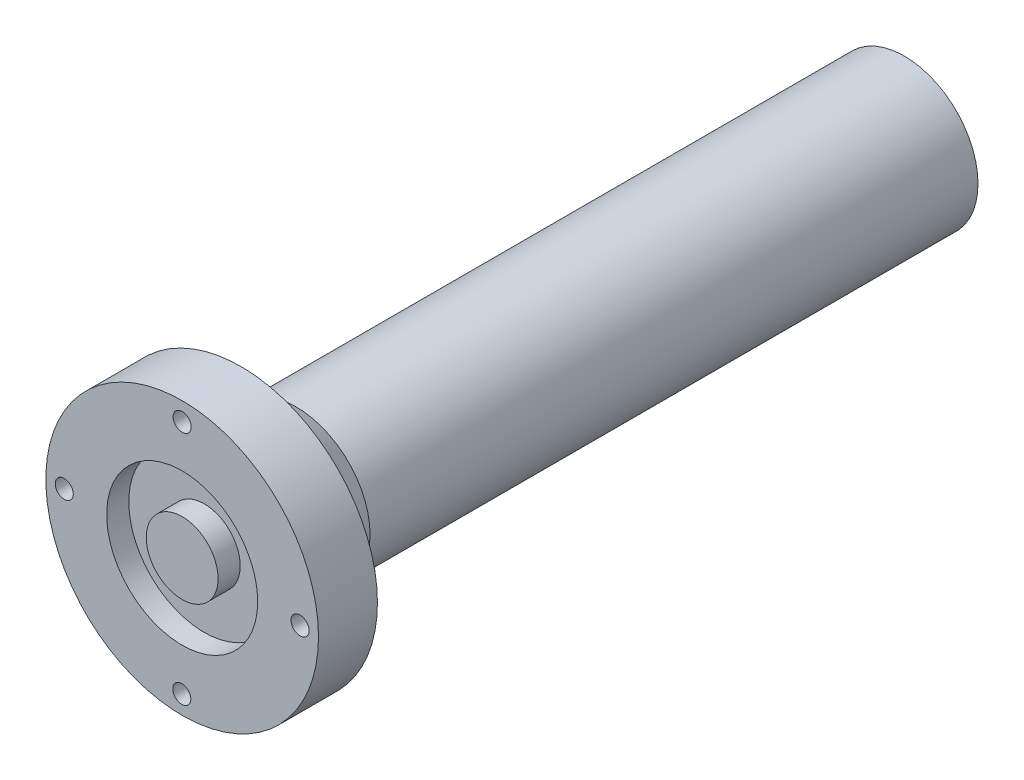
ISO-10303-21;
HEADER;
FILE_DESCRIPTION(('STEP AP214'),'2;1');
FILE_NAME('part.step','',(''),(''),'','','');
FILE_SCHEMA(('AUTOMOTIVE_DESIGN { 1 0 10303 214 1 1 1 1 }'));
ENDSEC;
DATA;
#1=APPLICATION_CONTEXT('core data for automotive mechanical design processes');
#2=APPLICATION_PROTOCOL_DEFINITION('international standard','automotive_design',2000,#1);
#3=PRODUCT_CONTEXT('',#1,'mechanical');
#4=PRODUCT('Part','Part','',(#3));
#5=PRODUCT_RELATED_PRODUCT_CATEGORY('part','',(#4));
#6=PRODUCT_DEFINITION_FORMATION('','',#4);
#7=PRODUCT_DEFINITION_CONTEXT('part definition',#1,'design');
#8=PRODUCT_DEFINITION('design','',#6,#7);
#9=PRODUCT_DEFINITION_SHAPE('','',#8);
#10=(LENGTH_UNIT() NAMED_UNIT(*) SI_UNIT(.MILLI.,.METRE.));
#11=(NAMED_UNIT(*) PLANE_ANGLE_UNIT() SI_UNIT($,.RADIAN.));
#12=(NAMED_UNIT(*) SI_UNIT($,.STERADIAN.) SOLID_ANGLE_UNIT());
#13=UNCERTAINTY_MEASURE_WITH_UNIT(LENGTH_MEASURE(1.E-05),#10,'distance_accuracy_value','');
#14=(GEOMETRIC_REPRESENTATION_CONTEXT(3) GLOBAL_UNCERTAINTY_ASSIGNED_CONTEXT((#13)) GLOBAL_UNIT_ASSIGNED_CONTEXT((#10,
#11,#12)) REPRESENTATION_CONTEXT('',''));
#15=CARTESIAN_POINT('',(0.,0.,0.));
#16=DIRECTION('',(0.,0.,1.));
#17=DIRECTION('',(1.,0.,0.));
#18=AXIS2_PLACEMENT_3D('',#15,#16,#17);
#19=CARTESIAN_POINT('',(-0.10813940247166,-32.,-0.001000000000001));
#20=DIRECTION('',(0.,0.,1.));
#21=DIRECTION('',(1.,0.,0.));
#22=AXIS2_PLACEMENT_3D('',#19,#20,#21);
#23=CYLINDRICAL_SURFACE('',#22,2.45);
#24=CARTESIAN_POINT('',(-0.10813940247166,-32.,196.));
#25=DIRECTION('',(0.,0.,1.));
#26=DIRECTION('',(1.,0.,0.));
#27=AXIS2_PLACEMENT_3D('',#24,#25,#26);
#28=CIRCLE('',#27,2.45);
#29=CARTESIAN_POINT('',(2.34186059752834,-32.,196.));
#30=VERTEX_POINT('',#29);
#31=EDGE_CURVE('E108',#30,#30,#28,.T.);
#32=ORIENTED_EDGE('',*,*,#31,.T.);
#33=EDGE_LOOP('',(#32));
#34=FACE_BOUND('',#33,.T.);
#35=CARTESIAN_POINT('',(-0.10813940247166,-32.,185.));
#36=DIRECTION('',(0.,0.,-1.));
#37=DIRECTION('',(-1.,0.,0.));
#38=AXIS2_PLACEMENT_3D('',#35,#36,#37);
#39=CIRCLE('',#38,2.45);
#40=CARTESIAN_POINT('',(-2.55813940247166,-32.,185.));
#41=VERTEX_POINT('',#40);
#42=EDGE_CURVE('E112',#41,#41,#39,.F.);
#43=ORIENTED_EDGE('',*,*,#42,.F.);
#44=EDGE_LOOP('',(#43));
#45=FACE_BOUND('',#44,.T.);
#46=ADVANCED_FACE('F43',(#34,#45),#23,.F.);
#47=CARTESIAN_POINT('',(-32.,0.258434211494532,-0.001000000000001));
#48=DIRECTION('',(0.,0.,1.));
#49=DIRECTION('',(1.,0.,0.));
#50=AXIS2_PLACEMENT_3D('',#47,#48,#49);
#51=CYLINDRICAL_SURFACE('',#50,2.45);
#52=CARTESIAN_POINT('',(-32.,0.258434211494532,196.));
#53=DIRECTION('',(0.,0.,1.));
#54=DIRECTION('',(1.,0.,0.));
#55=AXIS2_PLACEMENT_3D('',#52,#53,#54);
#56=CIRCLE('',#55,2.45);
#57=CARTESIAN_POINT('',(-29.55,0.258434211494532,196.));
#58=VERTEX_POINT('',#57);
#59=EDGE_CURVE('E104',#58,#58,#56,.T.);
#60=ORIENTED_EDGE('',*,*,#59,.T.);
#61=EDGE_LOOP('',(#60));
#62=FACE_BOUND('',#61,.T.);
#63=CARTESIAN_POINT('',(-32.,0.258434211494532,185.));
#64=DIRECTION('',(0.,0.,-1.));
#65=DIRECTION('',(-1.,0.,0.));
#66=AXIS2_PLACEMENT_3D('',#63,#64,#65);
#67=CIRCLE('',#66,2.45);
#68=CARTESIAN_POINT('',(-34.45,0.258434211494532,185.));
#69=VERTEX_POINT('',#68);
#70=EDGE_CURVE('E146',#69,#69,#67,.F.);
#71=ORIENTED_EDGE('',*,*,#70,.F.);
#72=EDGE_LOOP('',(#71));
#73=FACE_BOUND('',#72,.T.);
#74=ADVANCED_FACE('F156',(#62,#73),#51,.F.);
#75=CARTESIAN_POINT('',(32.,0.150294809022872,-0.001000000000001));
#76=DIRECTION('',(0.,0.,1.));
#77=DIRECTION('',(1.,0.,0.));
#78=AXIS2_PLACEMENT_3D('',#75,#76,#77);
#79=CYLINDRICAL_SURFACE('',#78,2.45);
#80=CARTESIAN_POINT('',(32.,0.150294809022872,196.));
#81=DIRECTION('',(0.,0.,1.));
#82=DIRECTION('',(1.,0.,0.));
#83=AXIS2_PLACEMENT_3D('',#80,#81,#82);
#84=CIRCLE('',#83,2.45);
#85=CARTESIAN_POINT('',(34.45,0.150294809022872,196.));
#86=VERTEX_POINT('',#85);
#87=EDGE_CURVE('E100',#86,#86,#84,.T.);
#88=ORIENTED_EDGE('',*,*,#87,.T.);
#89=EDGE_LOOP('',(#88));
#90=FACE_BOUND('',#89,.T.);
#91=CARTESIAN_POINT('',(32.,0.150294809022872,185.));
#92=DIRECTION('',(0.,0.,-1.));
#93=DIRECTION('',(-1.,0.,0.));
#94=AXIS2_PLACEMENT_3D('',#91,#92,#93);
#95=CIRCLE('',#94,2.45);
#96=CARTESIAN_POINT('',(29.55,0.150294809022872,185.));
#97=VERTEX_POINT('',#96);
#98=EDGE_CURVE('E142',#97,#97,#95,.F.);
#99=ORIENTED_EDGE('',*,*,#98,.F.);
#100=EDGE_LOOP('',(#99));
#101=FACE_BOUND('',#100,.T.);
#102=ADVANCED_FACE('F162',(#90,#101),#79,.F.);
#103=CARTESIAN_POINT('',(0.,32.,-0.001000000000001));
#104=DIRECTION('',(0.,0.,1.));
#105=DIRECTION('',(1.,0.,0.));
#106=AXIS2_PLACEMENT_3D('',#103,#104,#105);
#107=CYLINDRICAL_SURFACE('',#106,2.45);
#108=CARTESIAN_POINT('',(0.,32.,196.));
#109=DIRECTION('',(0.,0.,1.));
#110=DIRECTION('',(1.,0.,0.));
#111=AXIS2_PLACEMENT_3D('',#108,#109,#110);
#112=CIRCLE('',#111,2.45);
#113=CARTESIAN_POINT('',(2.45,32.,196.));
#114=VERTEX_POINT('',#113);
#115=EDGE_CURVE('E95',#114,#114,#112,.T.);
#116=ORIENTED_EDGE('',*,*,#115,.T.);
#117=EDGE_LOOP('',(#116));
#118=FACE_BOUND('',#117,.T.);
#119=CARTESIAN_POINT('',(0.,32.,185.));
#120=DIRECTION('',(0.,0.,-1.));
#121=DIRECTION('',(-1.,0.,0.));
#122=AXIS2_PLACEMENT_3D('',#119,#120,#121);
#123=CIRCLE('',#122,2.45);
#124=CARTESIAN_POINT('',(-2.45,32.,185.));
#125=VERTEX_POINT('',#124);
#126=EDGE_CURVE('E69',#125,#125,#123,.F.);
#127=ORIENTED_EDGE('',*,*,#126,.F.);
#128=EDGE_LOOP('',(#127));
#129=FACE_BOUND('',#128,.T.);
#130=ADVANCED_FACE('F192',(#118,#129),#107,.F.);
#131=CARTESIAN_POINT('',(0.,0.,196.));
#132=DIRECTION('',(0.,0.,-1.));
#133=DIRECTION('',(-1.,0.,0.));
#134=AXIS2_PLACEMENT_3D('',#131,#132,#133);
#135=CYLINDRICAL_SURFACE('',#134,37.);
#136=CARTESIAN_POINT('',(0.,0.,196.));
#137=DIRECTION('',(0.,0.,1.));
#138=DIRECTION('',(1.,0.,0.));
#139=AXIS2_PLACEMENT_3D('',#136,#137,#138);
#140=CIRCLE('',#139,37.);
#141=CARTESIAN_POINT('',(37.,0.,196.));
#142=VERTEX_POINT('',#141);
#143=EDGE_CURVE('E129',#142,#142,#140,.T.);
#144=ORIENTED_EDGE('',*,*,#143,.F.);
#145=EDGE_LOOP('',(#144));
#146=FACE_BOUND('',#145,.T.);
#147=CARTESIAN_POINT('',(0.,0.,180.));
#148=DIRECTION('',(0.,0.,1.));
#149=DIRECTION('',(1.,0.,0.));
#150=AXIS2_PLACEMENT_3D('',#147,#148,#149);
#151=CIRCLE('',#150,37.);
#152=CARTESIAN_POINT('',(37.,0.,180.));
#153=VERTEX_POINT('',#152);
#154=EDGE_CURVE('E125',#153,#153,#151,.T.);
#155=ORIENTED_EDGE('',*,*,#154,.T.);
#156=EDGE_LOOP('',(#155));
#157=FACE_BOUND('',#156,.T.);
#158=ADVANCED_FACE('F187',(#146,#157),#135,.T.);
#159=CARTESIAN_POINT('',(0.,0.,196.));
#160=DIRECTION('',(0.,0.,1.));
#161=DIRECTION('',(1.,0.,0.));
#162=AXIS2_PLACEMENT_3D('',#159,#160,#161);
#163=PLANE('',#162);
#164=ORIENTED_EDGE('',*,*,#115,.F.);
#165=EDGE_LOOP('',(#164));
#166=FACE_BOUND('',#165,.T.);
#167=ORIENTED_EDGE('',*,*,#87,.F.);
#168=EDGE_LOOP('',(#167));
#169=FACE_BOUND('',#168,.T.);
#170=ORIENTED_EDGE('',*,*,#59,.F.);
#171=EDGE_LOOP('',(#170));
#172=FACE_BOUND('',#171,.T.);
#173=ORIENTED_EDGE('',*,*,#31,.F.);
#174=EDGE_LOOP('',(#173));
#175=FACE_BOUND('',#174,.T.);
#176=CARTESIAN_POINT('',(0.,0.,196.));
#177=DIRECTION('',(0.,0.,1.));
#178=DIRECTION('',(1.,0.,0.));
#179=AXIS2_PLACEMENT_3D('',#176,#177,#178);
#180=CIRCLE('',#179,20.5);
#181=CARTESIAN_POINT('',(20.5,0.,196.));
#182=VERTEX_POINT('',#181);
#183=EDGE_CURVE('E117',#182,#182,#180,.T.);
#184=ORIENTED_EDGE('',*,*,#183,.F.);
#185=EDGE_LOOP('',(#184));
#186=FACE_BOUND('',#185,.T.);
#187=ORIENTED_EDGE('',*,*,#143,.T.);
#188=EDGE_LOOP('',(#187));
#189=FACE_BOUND('',#188,.T.);
#190=ADVANCED_FACE('F184',(#166,#169,#172,#175,#186,#189),#163,.T.);
#191=CARTESIAN_POINT('',(0.,0.,180.));
#192=DIRECTION('',(0.,0.,1.));
#193=DIRECTION('',(1.,0.,0.));
#194=AXIS2_PLACEMENT_3D('',#191,#192,#193);
#195=PLANE('',#194);
#196=CARTESIAN_POINT('',(0.,32.,180.));
#197=DIRECTION('',(0.,0.,-1.));
#198=DIRECTION('',(-1.,0.,0.));
#199=AXIS2_PLACEMENT_3D('',#196,#197,#198);
#200=CIRCLE('',#199,4.4);
#201=CARTESIAN_POINT('',(0.,27.6,180.));
#202=VERTEX_POINT('',#201);
#203=EDGE_CURVE('E56',#202,#202,#200,.T.);
#204=ORIENTED_EDGE('',*,*,#203,.F.);
#205=CARTESIAN_POINT('',(0.,0.,180.));
#206=DIRECTION('',(0.,0.,1.));
#207=DIRECTION('',(1.,0.,0.));
#208=AXIS2_PLACEMENT_3D('',#205,#206,#207);
#209=CIRCLE('',#208,27.6);
#210=EDGE_CURVE('E60',#202,#202,#209,.T.);
#211=ORIENTED_EDGE('',*,*,#210,.T.);
#212=EDGE_LOOP('',(#204,#211));
#213=FACE_BOUND('',#212,.T.);
#214=CARTESIAN_POINT('',(-32.,0.258434211494532,180.));
#215=DIRECTION('',(0.,0.,-1.));
#216=DIRECTION('',(-1.,0.,0.));
#217=AXIS2_PLACEMENT_3D('',#214,#215,#216);
#218=CIRCLE('',#217,4.4);
#219=CARTESIAN_POINT('',(-36.4,0.258434211494532,180.));
#220=VERTEX_POINT('',#219);
#221=EDGE_CURVE('E64',#220,#220,#218,.T.);
#222=ORIENTED_EDGE('',*,*,#221,.F.);
#223=EDGE_LOOP('',(#222));
#224=FACE_BOUND('',#223,.T.);
#225=CARTESIAN_POINT('',(-0.10813940247166,-32.,180.));
#226=DIRECTION('',(0.,0.,-1.));
#227=DIRECTION('',(-1.,0.,0.));
#228=AXIS2_PLACEMENT_3D('',#225,#226,#227);
#229=CIRCLE('',#228,4.4);
#230=CARTESIAN_POINT('',(-4.50813940247166,-32.,180.));
#231=VERTEX_POINT('',#230);
#232=EDGE_CURVE('E79',#231,#231,#229,.T.);
#233=ORIENTED_EDGE('',*,*,#232,.F.);
#234=EDGE_LOOP('',(#233));
#235=FACE_BOUND('',#234,.T.);
#236=CARTESIAN_POINT('',(32.,0.150294809022872,180.));
#237=DIRECTION('',(0.,0.,-1.));
#238=DIRECTION('',(-1.,0.,0.));
#239=AXIS2_PLACEMENT_3D('',#236,#237,#238);
#240=CIRCLE('',#239,4.4);
#241=CARTESIAN_POINT('',(27.6,0.150294809022872,180.));
#242=VERTEX_POINT('',#241);
#243=EDGE_CURVE('E87',#242,#242,#240,.T.);
#244=ORIENTED_EDGE('',*,*,#243,.F.);
#245=EDGE_LOOP('',(#244));
#246=FACE_BOUND('',#245,.T.);
#247=ORIENTED_EDGE('',*,*,#154,.F.);
#248=EDGE_LOOP('',(#247));
#249=FACE_BOUND('',#248,.T.);
#250=ADVANCED_FACE('F57',(#213,#224,#235,#246,#249),#195,.F.);
#251=CARTESIAN_POINT('',(0.,0.,190.));
#252=DIRECTION('',(0.,0.,1.));
#253=DIRECTION('',(1.,0.,0.));
#254=AXIS2_PLACEMENT_3D('',#251,#252,#253);
#255=CYLINDRICAL_SURFACE('',#254,20.5);
#256=CARTESIAN_POINT('',(0.,0.,190.));
#257=DIRECTION('',(0.,0.,1.));
#258=DIRECTION('',(1.,0.,0.));
#259=AXIS2_PLACEMENT_3D('',#256,#257,#258);
#260=CIRCLE('',#259,20.5);
#261=CARTESIAN_POINT('',(20.5,0.,190.));
#262=VERTEX_POINT('',#261);
#263=EDGE_CURVE('E121',#262,#262,#260,.T.);
#264=ORIENTED_EDGE('',*,*,#263,.F.);
#265=EDGE_LOOP('',(#264));
#266=FACE_BOUND('',#265,.T.);
#267=ORIENTED_EDGE('',*,*,#183,.T.);
#268=EDGE_LOOP('',(#267));
#269=FACE_BOUND('',#268,.T.);
#270=ADVANCED_FACE('F179',(#266,#269),#255,.F.);
#271=CARTESIAN_POINT('',(0.,0.,190.));
#272=DIRECTION('',(0.,0.,1.));
#273=DIRECTION('',(1.,0.,0.));
#274=AXIS2_PLACEMENT_3D('',#271,#272,#273);
#275=PLANE('',#274);
#276=CARTESIAN_POINT('',(0.,0.,190.));
#277=DIRECTION('',(0.,0.,1.));
#278=DIRECTION('',(1.,0.,0.));
#279=AXIS2_PLACEMENT_3D('',#276,#277,#278);
#280=CIRCLE('',#279,9.75);
#281=CARTESIAN_POINT('',(9.75,0.,190.));
#282=VERTEX_POINT('',#281);
#283=EDGE_CURVE('E99',#282,#282,#280,.T.);
#284=ORIENTED_EDGE('',*,*,#283,.F.);
#285=EDGE_LOOP('',(#284));
#286=FACE_BOUND('',#285,.T.);
#287=ORIENTED_EDGE('',*,*,#263,.T.);
#288=EDGE_LOOP('',(#287));
#289=FACE_BOUND('',#288,.T.);
#290=ADVANCED_FACE('F175',(#286,#289),#275,.T.);
#291=CARTESIAN_POINT('',(0.,0.,196.));
#292=DIRECTION('',(0.,0.,-1.));
#293=DIRECTION('',(-1.,0.,0.));
#294=AXIS2_PLACEMENT_3D('',#291,#292,#293);
#295=CYLINDRICAL_SURFACE('',#294,9.75);
#296=CARTESIAN_POINT('',(0.,0.,196.));
#297=DIRECTION('',(0.,0.,1.));
#298=DIRECTION('',(1.,0.,0.));
#299=AXIS2_PLACEMENT_3D('',#296,#297,#298);
#300=CIRCLE('',#299,9.75);
#301=CARTESIAN_POINT('',(9.75,0.,196.));
#302=VERTEX_POINT('',#301);
#303=EDGE_CURVE('E113',#302,#302,#300,.T.);
#304=ORIENTED_EDGE('',*,*,#303,.F.);
#305=EDGE_LOOP('',(#304));
#306=FACE_BOUND('',#305,.T.);
#307=ORIENTED_EDGE('',*,*,#283,.T.);
#308=EDGE_LOOP('',(#307));
#309=FACE_BOUND('',#308,.T.);
#310=ADVANCED_FACE('F171',(#306,#309),#295,.T.);
#311=CARTESIAN_POINT('',(0.,0.,196.));
#312=DIRECTION('',(0.,0.,1.));
#313=DIRECTION('',(1.,0.,0.));
#314=AXIS2_PLACEMENT_3D('',#311,#312,#313);
#315=PLANE('',#314);
#316=ORIENTED_EDGE('',*,*,#303,.T.);
#317=EDGE_LOOP('',(#316));
#318=FACE_BOUND('',#317,.T.);
#319=ADVANCED_FACE('F167',(#318),#315,.T.);
#320=CARTESIAN_POINT('',(0.,32.,185.));
#321=DIRECTION('',(0.,0.,-1.));
#322=DIRECTION('',(-1.,0.,0.));
#323=AXIS2_PLACEMENT_3D('',#320,#321,#322);
#324=PLANE('',#323);
#325=CARTESIAN_POINT('',(0.,32.,185.));
#326=DIRECTION('',(0.,0.,-1.));
#327=DIRECTION('',(-1.,0.,0.));
#328=AXIS2_PLACEMENT_3D('',#325,#326,#327);
#329=CIRCLE('',#328,4.4);
#330=CARTESIAN_POINT('',(-4.4,32.,185.));
#331=VERTEX_POINT('',#330);
#332=EDGE_CURVE('E63',#331,#331,#329,.T.);
#333=ORIENTED_EDGE('',*,*,#332,.T.);
#334=EDGE_LOOP('',(#333));
#335=FACE_BOUND('',#334,.T.);
#336=ORIENTED_EDGE('',*,*,#126,.T.);
#337=EDGE_LOOP('',(#336));
#338=FACE_BOUND('',#337,.T.);
#339=ADVANCED_FACE('F170',(#335,#338),#324,.T.);
#340=CARTESIAN_POINT('',(0.,32.,185.));
#341=DIRECTION('',(0.,0.,-1.));
#342=DIRECTION('',(-1.,0.,0.));
#343=AXIS2_PLACEMENT_3D('',#340,#341,#342);
#344=CYLINDRICAL_SURFACE('',#343,4.4);
#345=ORIENTED_EDGE('',*,*,#332,.F.);
#346=EDGE_LOOP('',(#345));
#347=FACE_BOUND('',#346,.T.);
#348=ORIENTED_EDGE('',*,*,#203,.T.);
#349=EDGE_LOOP('',(#348));
#350=FACE_BOUND('',#349,.T.);
#351=ADVANCED_FACE('F220',(#347,#350),#344,.F.);
#352=CARTESIAN_POINT('',(32.,0.150294809022872,185.));
#353=DIRECTION('',(0.,0.,-1.));
#354=DIRECTION('',(-1.,0.,0.));
#355=AXIS2_PLACEMENT_3D('',#352,#353,#354);
#356=PLANE('',#355);
#357=CARTESIAN_POINT('',(32.,0.150294809022872,185.));
#358=DIRECTION('',(0.,0.,-1.));
#359=DIRECTION('',(-1.,0.,0.));
#360=AXIS2_PLACEMENT_3D('',#357,#358,#359);
#361=CIRCLE('',#360,4.4);
#362=CARTESIAN_POINT('',(27.6,0.150294809022872,185.));
#363=VERTEX_POINT('',#362);
#364=EDGE_CURVE('E91',#363,#363,#361,.T.);
#365=ORIENTED_EDGE('',*,*,#364,.T.);
#366=EDGE_LOOP('',(#365));
#367=FACE_BOUND('',#366,.T.);
#368=ORIENTED_EDGE('',*,*,#98,.T.);
#369=EDGE_LOOP('',(#368));
#370=FACE_BOUND('',#369,.T.);
#371=ADVANCED_FACE('F224',(#367,#370),#356,.T.);
#372=CARTESIAN_POINT('',(32.,0.150294809022872,185.));
#373=DIRECTION('',(0.,0.,-1.));
#374=DIRECTION('',(-1.,0.,0.));
#375=AXIS2_PLACEMENT_3D('',#372,#373,#374);
#376=CYLINDRICAL_SURFACE('',#375,4.4);
#377=ORIENTED_EDGE('',*,*,#364,.F.);
#378=EDGE_LOOP('',(#377));
#379=FACE_BOUND('',#378,.T.);
#380=ORIENTED_EDGE('',*,*,#243,.T.);
#381=EDGE_LOOP('',(#380));
#382=FACE_BOUND('',#381,.T.);
#383=ADVANCED_FACE('F232',(#379,#382),#376,.F.);
#384=CARTESIAN_POINT('',(-32.,0.258434211494532,185.));
#385=DIRECTION('',(0.,0.,-1.));
#386=DIRECTION('',(-1.,0.,0.));
#387=AXIS2_PLACEMENT_3D('',#384,#385,#386);
#388=PLANE('',#387);
#389=CARTESIAN_POINT('',(-32.,0.258434211494532,185.));
#390=DIRECTION('',(0.,0.,-1.));
#391=DIRECTION('',(-1.,0.,0.));
#392=AXIS2_PLACEMENT_3D('',#389,#390,#391);
#393=CIRCLE('',#392,4.4);
#394=CARTESIAN_POINT('',(-36.4,0.258434211494532,185.));
#395=VERTEX_POINT('',#394);
#396=EDGE_CURVE('E72',#395,#395,#393,.T.);
#397=ORIENTED_EDGE('',*,*,#396,.T.);
#398=EDGE_LOOP('',(#397));
#399=FACE_BOUND('',#398,.T.);
#400=ORIENTED_EDGE('',*,*,#70,.T.);
#401=EDGE_LOOP('',(#400));
#402=FACE_BOUND('',#401,.T.);
#403=ADVANCED_FACE('F229',(#399,#402),#388,.T.);
#404=CARTESIAN_POINT('',(-32.,0.258434211494532,185.));
#405=DIRECTION('',(0.,0.,-1.));
#406=DIRECTION('',(-1.,0.,0.));
#407=AXIS2_PLACEMENT_3D('',#404,#405,#406);
#408=CYLINDRICAL_SURFACE('',#407,4.4);
#409=ORIENTED_EDGE('',*,*,#396,.F.);
#410=EDGE_LOOP('',(#409));
#411=FACE_BOUND('',#410,.T.);
#412=ORIENTED_EDGE('',*,*,#221,.T.);
#413=EDGE_LOOP('',(#412));
#414=FACE_BOUND('',#413,.T.);
#415=ADVANCED_FACE('F226',(#411,#414),#408,.F.);
#416=CARTESIAN_POINT('',(-0.10813940247166,-32.,185.));
#417=DIRECTION('',(0.,0.,-1.));
#418=DIRECTION('',(-1.,0.,0.));
#419=AXIS2_PLACEMENT_3D('',#416,#417,#418);
#420=PLANE('',#419);
#421=CARTESIAN_POINT('',(-0.10813940247166,-32.,185.));
#422=DIRECTION('',(0.,0.,-1.));
#423=DIRECTION('',(-1.,0.,0.));
#424=AXIS2_PLACEMENT_3D('',#421,#422,#423);
#425=CIRCLE('',#424,4.4);
#426=CARTESIAN_POINT('',(-4.50813940247166,-32.,185.));
#427=VERTEX_POINT('',#426);
#428=EDGE_CURVE('E83',#427,#427,#425,.T.);
#429=ORIENTED_EDGE('',*,*,#428,.T.);
#430=EDGE_LOOP('',(#429));
#431=FACE_BOUND('',#430,.T.);
#432=ORIENTED_EDGE('',*,*,#42,.T.);
#433=EDGE_LOOP('',(#432));
#434=FACE_BOUND('',#433,.T.);
#435=ADVANCED_FACE('F153',(#431,#434),#420,.T.);
#436=CARTESIAN_POINT('',(-0.10813940247166,-32.,185.));
#437=DIRECTION('',(0.,0.,-1.));
#438=DIRECTION('',(-1.,0.,0.));
#439=AXIS2_PLACEMENT_3D('',#436,#437,#438);
#440=CYLINDRICAL_SURFACE('',#439,4.4);
#441=ORIENTED_EDGE('',*,*,#428,.F.);
#442=EDGE_LOOP('',(#441));
#443=FACE_BOUND('',#442,.T.);
#444=ORIENTED_EDGE('',*,*,#232,.T.);
#445=EDGE_LOOP('',(#444));
#446=FACE_BOUND('',#445,.T.);
#447=ADVANCED_FACE('F204',(#443,#446),#440,.F.);
#448=CARTESIAN_POINT('',(0.,0.,165.));
#449=DIRECTION('',(0.,0.,1.));
#450=DIRECTION('',(1.,0.,0.));
#451=AXIS2_PLACEMENT_3D('',#448,#449,#450);
#452=CONICAL_SURFACE('',#451,20.,0.468966707772321);
#453=ORIENTED_EDGE('',*,*,#210,.F.);
#454=EDGE_LOOP('',(#453));
#455=FACE_BOUND('',#454,.T.);
#456=CARTESIAN_POINT('',(0.,0.,165.));
#457=DIRECTION('',(0.,0.,1.));
#458=DIRECTION('',(1.,0.,0.));
#459=AXIS2_PLACEMENT_3D('',#456,#457,#458);
#460=CIRCLE('',#459,20.);
#461=CARTESIAN_POINT('',(20.,0.,165.));
#462=VERTEX_POINT('',#461);
#463=EDGE_CURVE('E11',#462,#462,#460,.T.);
#464=ORIENTED_EDGE('',*,*,#463,.T.);
#465=EDGE_LOOP('',(#464));
#466=FACE_BOUND('',#465,.T.);
#467=ADVANCED_FACE('F196',(#455,#466),#452,.T.);
#468=CARTESIAN_POINT('',(0.,0.,0.));
#469=DIRECTION('',(0.,0.,1.));
#470=DIRECTION('',(1.,0.,0.));
#471=AXIS2_PLACEMENT_3D('',#468,#469,#470);
#472=PLANE('',#471);
#473=CARTESIAN_POINT('',(0.,0.,0.));
#474=DIRECTION('',(0.,0.,1.));
#475=DIRECTION('',(1.,0.,0.));
#476=AXIS2_PLACEMENT_3D('',#473,#474,#475);
#477=CIRCLE('',#476,20.);
#478=CARTESIAN_POINT('',(20.,0.,0.));
#479=VERTEX_POINT('',#478);
#480=EDGE_CURVE('E51',#479,#479,#477,.T.);
#481=ORIENTED_EDGE('',*,*,#480,.F.);
#482=EDGE_LOOP('',(#481));
#483=FACE_BOUND('',#482,.T.);
#484=ADVANCED_FACE('F194',(#483),#472,.F.);
#485=CARTESIAN_POINT('',(0.,0.,180.));
#486=DIRECTION('',(0.,0.,-1.));
#487=DIRECTION('',(-1.,0.,0.));
#488=AXIS2_PLACEMENT_3D('',#485,#486,#487);
#489=CYLINDRICAL_SURFACE('',#488,20.);
#490=ORIENTED_EDGE('',*,*,#480,.T.);
#491=EDGE_LOOP('',(#490));
#492=FACE_BOUND('',#491,.T.);
#493=ORIENTED_EDGE('',*,*,#463,.F.);
#494=EDGE_LOOP('',(#493));
#495=FACE_BOUND('',#494,.T.);
#496=ADVANCED_FACE('F45',(#492,#495),#489,.T.);
#497=CLOSED_SHELL('',(#46,#74,#102,#130,#158,#190,#250,#270,#290,#310,#319,#339,#351,#371,#383,
#403,#415,#435,#447,#467,#484,#496));
#498=MANIFOLD_SOLID_BREP('B2',#497);
#499=ADVANCED_BREP_SHAPE_REPRESENTATION('',(#18,#498),#14);
#500=SHAPE_DEFINITION_REPRESENTATION(#9,#499);
ENDSEC;
END-ISO-10303-21;
